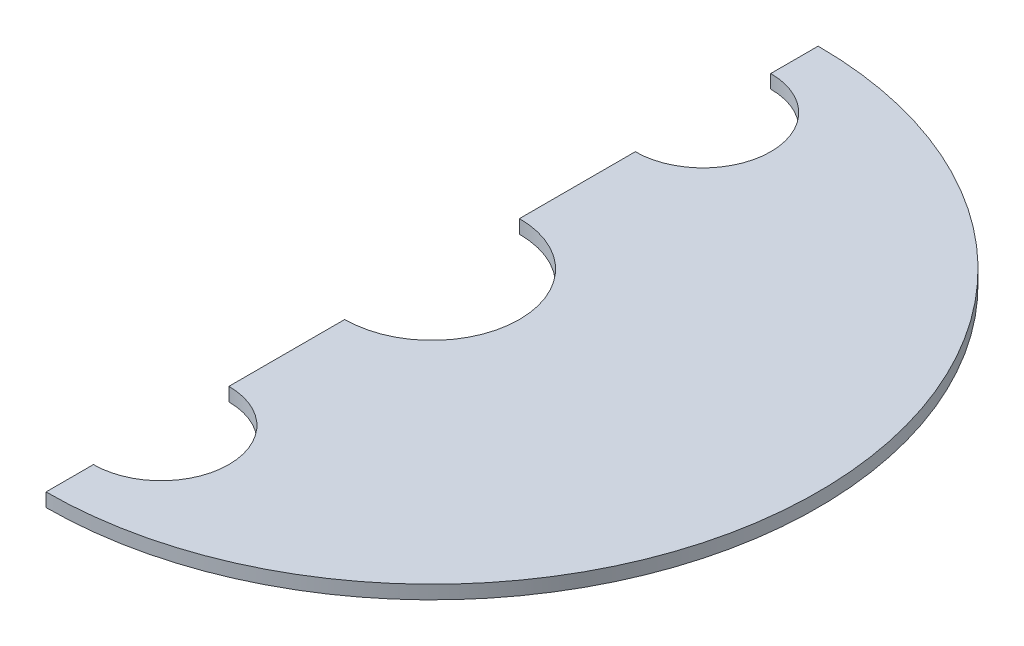
ISO-10303-21;
HEADER;
FILE_DESCRIPTION(('STEP AP214'),'2;1');
FILE_NAME('part.step','',(''),(''),'','','');
FILE_SCHEMA(('AUTOMOTIVE_DESIGN { 1 0 10303 214 1 1 1 1 }'));
ENDSEC;
DATA;
#1=APPLICATION_CONTEXT('core data for automotive mechanical design processes');
#2=APPLICATION_PROTOCOL_DEFINITION('international standard','automotive_design',2000,#1);
#3=PRODUCT_CONTEXT('',#1,'mechanical');
#4=PRODUCT('Part','Part','',(#3));
#5=PRODUCT_RELATED_PRODUCT_CATEGORY('part','',(#4));
#6=PRODUCT_DEFINITION_FORMATION('','',#4);
#7=PRODUCT_DEFINITION_CONTEXT('part definition',#1,'design');
#8=PRODUCT_DEFINITION('design','',#6,#7);
#9=PRODUCT_DEFINITION_SHAPE('','',#8);
#10=(LENGTH_UNIT() NAMED_UNIT(*) SI_UNIT(.MILLI.,.METRE.));
#11=(NAMED_UNIT(*) PLANE_ANGLE_UNIT() SI_UNIT($,.RADIAN.));
#12=(NAMED_UNIT(*) SI_UNIT($,.STERADIAN.) SOLID_ANGLE_UNIT());
#13=UNCERTAINTY_MEASURE_WITH_UNIT(LENGTH_MEASURE(1.E-05),#10,'distance_accuracy_value','');
#14=(GEOMETRIC_REPRESENTATION_CONTEXT(3) GLOBAL_UNCERTAINTY_ASSIGNED_CONTEXT((#13)) GLOBAL_UNIT_ASSIGNED_CONTEXT((#10,
#11,#12)) REPRESENTATION_CONTEXT('',''));
#15=CARTESIAN_POINT('',(0.,0.,0.));
#16=DIRECTION('',(0.,0.,1.));
#17=DIRECTION('',(1.,0.,0.));
#18=AXIS2_PLACEMENT_3D('',#15,#16,#17);
#19=CARTESIAN_POINT('',(0.,1.,-20.));
#20=DIRECTION('',(0.,-1.,0.));
#21=DIRECTION('',(0.,0.,-1.));
#22=AXIS2_PLACEMENT_3D('',#19,#20,#21);
#23=CYLINDRICAL_SURFACE('',#22,5.);
#24=CARTESIAN_POINT('',(0.,0.,-20.));
#25=DIRECTION('',(0.,1.,0.));
#26=DIRECTION('',(0.,0.,1.));
#27=AXIS2_PLACEMENT_3D('',#24,#25,#26);
#28=CIRCLE('',#27,5.);
#29=CARTESIAN_POINT('',(0.,0.,-15.));
#30=VERTEX_POINT('',#29);
#31=CARTESIAN_POINT('',(0.,0.,-25.));
#32=VERTEX_POINT('',#31);
#33=EDGE_CURVE('E129',#30,#32,#28,.T.);
#34=ORIENTED_EDGE('',*,*,#33,.F.);
#35=DIRECTION('',(0.,-1.,0.));
#36=VECTOR('',#35,1.);
#37=CARTESIAN_POINT('',(0.,1.,-15.));
#38=LINE('',#37,#36);
#39=CARTESIAN_POINT('',(0.,1.,-15.));
#40=VERTEX_POINT('',#39);
#41=EDGE_CURVE('E11',#40,#30,#38,.T.);
#42=ORIENTED_EDGE('',*,*,#41,.F.);
#43=CARTESIAN_POINT('',(0.,1.,-20.));
#44=DIRECTION('',(0.,1.,0.));
#45=DIRECTION('',(0.,0.,1.));
#46=AXIS2_PLACEMENT_3D('',#43,#44,#45);
#47=CIRCLE('',#46,5.);
#48=CARTESIAN_POINT('',(0.,1.,-25.));
#49=VERTEX_POINT('',#48);
#50=EDGE_CURVE('E148',#40,#49,#47,.T.);
#51=ORIENTED_EDGE('',*,*,#50,.T.);
#52=DIRECTION('',(0.,-1.,0.));
#53=VECTOR('',#52,1.);
#54=CARTESIAN_POINT('',(0.,1.,-25.));
#55=LINE('',#54,#53);
#56=EDGE_CURVE('E89',#49,#32,#55,.T.);
#57=ORIENTED_EDGE('',*,*,#56,.T.);
#58=EDGE_LOOP('',(#34,#42,#51,#57));
#59=FACE_BOUND('',#58,.T.);
#60=ADVANCED_FACE('F38',(#59),#23,.F.);
#61=CARTESIAN_POINT('',(0.,1.,0.));
#62=DIRECTION('',(-1.,0.,0.));
#63=DIRECTION('',(0.,0.,1.));
#64=AXIS2_PLACEMENT_3D('',#61,#62,#63);
#65=PLANE('',#64);
#66=DIRECTION('',(0.,0.,-1.));
#67=VECTOR('',#66,1.);
#68=CARTESIAN_POINT('',(0.,0.,0.));
#69=LINE('',#68,#67);
#70=CARTESIAN_POINT('',(0.,0.,-6.45));
#71=VERTEX_POINT('',#70);
#72=EDGE_CURVE('E132',#71,#30,#69,.T.);
#73=ORIENTED_EDGE('',*,*,#72,.F.);
#74=DIRECTION('',(0.,-1.,0.));
#75=VECTOR('',#74,1.);
#76=CARTESIAN_POINT('',(0.,1.,-6.45));
#77=LINE('',#76,#75);
#78=CARTESIAN_POINT('',(0.,1.,-6.45));
#79=VERTEX_POINT('',#78);
#80=EDGE_CURVE('E46',#79,#71,#77,.T.);
#81=ORIENTED_EDGE('',*,*,#80,.F.);
#82=DIRECTION('',(0.,0.,-1.));
#83=VECTOR('',#82,1.);
#84=CARTESIAN_POINT('',(0.,1.,0.));
#85=LINE('',#84,#83);
#86=EDGE_CURVE('E176',#79,#40,#85,.T.);
#87=ORIENTED_EDGE('',*,*,#86,.T.);
#88=ORIENTED_EDGE('',*,*,#41,.T.);
#89=EDGE_LOOP('',(#73,#81,#87,#88));
#90=FACE_BOUND('',#89,.T.);
#91=ADVANCED_FACE('F165',(#90),#65,.T.);
#92=CARTESIAN_POINT('',(0.,1.,0.));
#93=DIRECTION('',(0.,-1.,0.));
#94=DIRECTION('',(0.,0.,-1.));
#95=AXIS2_PLACEMENT_3D('',#92,#93,#94);
#96=CYLINDRICAL_SURFACE('',#95,6.45);
#97=CARTESIAN_POINT('',(0.,0.,0.));
#98=DIRECTION('',(0.,1.,0.));
#99=DIRECTION('',(0.,0.,1.));
#100=AXIS2_PLACEMENT_3D('',#97,#98,#99);
#101=CIRCLE('',#100,6.45);
#102=CARTESIAN_POINT('',(0.,0.,6.45));
#103=VERTEX_POINT('',#102);
#104=EDGE_CURVE('E135',#103,#71,#101,.T.);
#105=ORIENTED_EDGE('',*,*,#104,.F.);
#106=DIRECTION('',(0.,-1.,0.));
#107=VECTOR('',#106,1.);
#108=CARTESIAN_POINT('',(0.,1.,6.45));
#109=LINE('',#108,#107);
#110=CARTESIAN_POINT('',(0.,1.,6.45));
#111=VERTEX_POINT('',#110);
#112=EDGE_CURVE('E154',#111,#103,#109,.T.);
#113=ORIENTED_EDGE('',*,*,#112,.F.);
#114=CARTESIAN_POINT('',(0.,1.,0.));
#115=DIRECTION('',(0.,1.,0.));
#116=DIRECTION('',(0.,0.,1.));
#117=AXIS2_PLACEMENT_3D('',#114,#115,#116);
#118=CIRCLE('',#117,6.45);
#119=EDGE_CURVE('E161',#111,#79,#118,.T.);
#120=ORIENTED_EDGE('',*,*,#119,.T.);
#121=ORIENTED_EDGE('',*,*,#80,.T.);
#122=EDGE_LOOP('',(#105,#113,#120,#121));
#123=FACE_BOUND('',#122,.T.);
#124=ADVANCED_FACE('F159',(#123),#96,.F.);
#125=CARTESIAN_POINT('',(0.,1.,0.));
#126=DIRECTION('',(1.,0.,0.));
#127=DIRECTION('',(0.,0.,-1.));
#128=AXIS2_PLACEMENT_3D('',#125,#126,#127);
#129=PLANE('',#128);
#130=DIRECTION('',(0.,0.,1.));
#131=VECTOR('',#130,1.);
#132=CARTESIAN_POINT('',(0.,0.,0.));
#133=LINE('',#132,#131);
#134=CARTESIAN_POINT('',(0.,0.,15.));
#135=VERTEX_POINT('',#134);
#136=EDGE_CURVE('E138',#103,#135,#133,.T.);
#137=ORIENTED_EDGE('',*,*,#136,.T.);
#138=DIRECTION('',(0.,-1.,0.));
#139=VECTOR('',#138,1.);
#140=CARTESIAN_POINT('',(0.,1.,15.));
#141=LINE('',#140,#139);
#142=CARTESIAN_POINT('',(0.,1.,15.));
#143=VERTEX_POINT('',#142);
#144=EDGE_CURVE('E152',#143,#135,#141,.T.);
#145=ORIENTED_EDGE('',*,*,#144,.F.);
#146=DIRECTION('',(0.,0.,1.));
#147=VECTOR('',#146,1.);
#148=CARTESIAN_POINT('',(0.,1.,0.));
#149=LINE('',#148,#147);
#150=EDGE_CURVE('E174',#111,#143,#149,.T.);
#151=ORIENTED_EDGE('',*,*,#150,.F.);
#152=ORIENTED_EDGE('',*,*,#112,.T.);
#153=EDGE_LOOP('',(#137,#145,#151,#152));
#154=FACE_BOUND('',#153,.T.);
#155=ADVANCED_FACE('F172',(#154),#129,.F.);
#156=CARTESIAN_POINT('',(0.,1.,20.));
#157=DIRECTION('',(0.,-1.,0.));
#158=DIRECTION('',(0.,0.,-1.));
#159=AXIS2_PLACEMENT_3D('',#156,#157,#158);
#160=CYLINDRICAL_SURFACE('',#159,5.);
#161=CARTESIAN_POINT('',(0.,0.,20.));
#162=DIRECTION('',(0.,1.,0.));
#163=DIRECTION('',(0.,0.,1.));
#164=AXIS2_PLACEMENT_3D('',#161,#162,#163);
#165=CIRCLE('',#164,5.);
#166=CARTESIAN_POINT('',(0.,0.,25.));
#167=VERTEX_POINT('',#166);
#168=EDGE_CURVE('E141',#167,#135,#165,.T.);
#169=ORIENTED_EDGE('',*,*,#168,.F.);
#170=DIRECTION('',(0.,-1.,0.));
#171=VECTOR('',#170,1.);
#172=CARTESIAN_POINT('',(0.,1.,25.));
#173=LINE('',#172,#171);
#174=CARTESIAN_POINT('',(0.,1.,25.));
#175=VERTEX_POINT('',#174);
#176=EDGE_CURVE('E121',#175,#167,#173,.T.);
#177=ORIENTED_EDGE('',*,*,#176,.F.);
#178=CARTESIAN_POINT('',(0.,1.,20.));
#179=DIRECTION('',(0.,1.,0.));
#180=DIRECTION('',(0.,0.,1.));
#181=AXIS2_PLACEMENT_3D('',#178,#179,#180);
#182=CIRCLE('',#181,5.);
#183=EDGE_CURVE('E114',#175,#143,#182,.T.);
#184=ORIENTED_EDGE('',*,*,#183,.T.);
#185=ORIENTED_EDGE('',*,*,#144,.T.);
#186=EDGE_LOOP('',(#169,#177,#184,#185));
#187=FACE_BOUND('',#186,.T.);
#188=ADVANCED_FACE('F181',(#187),#160,.F.);
#189=CARTESIAN_POINT('',(0.,1.,0.));
#190=DIRECTION('',(1.,0.,0.));
#191=DIRECTION('',(0.,0.,-1.));
#192=AXIS2_PLACEMENT_3D('',#189,#190,#191);
#193=PLANE('',#192);
#194=DIRECTION('',(0.,0.,1.));
#195=VECTOR('',#194,1.);
#196=CARTESIAN_POINT('',(0.,0.,0.));
#197=LINE('',#196,#195);
#198=CARTESIAN_POINT('',(0.,0.,28.5));
#199=VERTEX_POINT('',#198);
#200=EDGE_CURVE('E120',#167,#199,#197,.T.);
#201=ORIENTED_EDGE('',*,*,#200,.T.);
#202=DIRECTION('',(0.,-1.,0.));
#203=VECTOR('',#202,1.);
#204=CARTESIAN_POINT('',(0.,1.,28.5));
#205=LINE('',#204,#203);
#206=CARTESIAN_POINT('',(0.,1.,28.5));
#207=VERTEX_POINT('',#206);
#208=EDGE_CURVE('E117',#207,#199,#205,.T.);
#209=ORIENTED_EDGE('',*,*,#208,.F.);
#210=DIRECTION('',(0.,0.,1.));
#211=VECTOR('',#210,1.);
#212=CARTESIAN_POINT('',(0.,1.,0.));
#213=LINE('',#212,#211);
#214=EDGE_CURVE('E108',#175,#207,#213,.T.);
#215=ORIENTED_EDGE('',*,*,#214,.F.);
#216=ORIENTED_EDGE('',*,*,#176,.T.);
#217=EDGE_LOOP('',(#201,#209,#215,#216));
#218=FACE_BOUND('',#217,.T.);
#219=ADVANCED_FACE('F118',(#218),#193,.F.);
#220=CARTESIAN_POINT('',(0.,1.,0.));
#221=DIRECTION('',(0.,-1.,0.));
#222=DIRECTION('',(0.,0.,-1.));
#223=AXIS2_PLACEMENT_3D('',#220,#221,#222);
#224=CYLINDRICAL_SURFACE('',#223,28.5);
#225=CARTESIAN_POINT('',(0.,0.,0.));
#226=DIRECTION('',(0.,1.,0.));
#227=DIRECTION('',(0.,0.,1.));
#228=AXIS2_PLACEMENT_3D('',#225,#226,#227);
#229=CIRCLE('',#228,28.5);
#230=CARTESIAN_POINT('',(0.,0.,-28.5));
#231=VERTEX_POINT('',#230);
#232=EDGE_CURVE('E82',#199,#231,#229,.T.);
#233=ORIENTED_EDGE('',*,*,#232,.T.);
#234=DIRECTION('',(0.,-1.,0.));
#235=VECTOR('',#234,1.);
#236=CARTESIAN_POINT('',(0.,1.,-28.5));
#237=LINE('',#236,#235);
#238=CARTESIAN_POINT('',(0.,1.,-28.5));
#239=VERTEX_POINT('',#238);
#240=EDGE_CURVE('E122',#239,#231,#237,.T.);
#241=ORIENTED_EDGE('',*,*,#240,.F.);
#242=CARTESIAN_POINT('',(0.,1.,0.));
#243=DIRECTION('',(0.,1.,0.));
#244=DIRECTION('',(0.,0.,1.));
#245=AXIS2_PLACEMENT_3D('',#242,#243,#244);
#246=CIRCLE('',#245,28.5);
#247=EDGE_CURVE('E112',#207,#239,#246,.T.);
#248=ORIENTED_EDGE('',*,*,#247,.F.);
#249=ORIENTED_EDGE('',*,*,#208,.T.);
#250=EDGE_LOOP('',(#233,#241,#248,#249));
#251=FACE_BOUND('',#250,.T.);
#252=ADVANCED_FACE('F124',(#251),#224,.T.);
#253=CARTESIAN_POINT('',(0.,1.,0.));
#254=DIRECTION('',(1.,0.,0.));
#255=DIRECTION('',(0.,0.,-1.));
#256=AXIS2_PLACEMENT_3D('',#253,#254,#255);
#257=PLANE('',#256);
#258=DIRECTION('',(0.,0.,1.));
#259=VECTOR('',#258,1.);
#260=CARTESIAN_POINT('',(0.,0.,0.));
#261=LINE('',#260,#259);
#262=EDGE_CURVE('E146',#231,#32,#261,.T.);
#263=ORIENTED_EDGE('',*,*,#262,.T.);
#264=ORIENTED_EDGE('',*,*,#56,.F.);
#265=DIRECTION('',(0.,0.,1.));
#266=VECTOR('',#265,1.);
#267=CARTESIAN_POINT('',(0.,1.,0.));
#268=LINE('',#267,#266);
#269=EDGE_CURVE('E54',#239,#49,#268,.T.);
#270=ORIENTED_EDGE('',*,*,#269,.F.);
#271=ORIENTED_EDGE('',*,*,#240,.T.);
#272=EDGE_LOOP('',(#263,#264,#270,#271));
#273=FACE_BOUND('',#272,.T.);
#274=ADVANCED_FACE('F184',(#273),#257,.F.);
#275=CARTESIAN_POINT('',(0.,1.,0.));
#276=DIRECTION('',(0.,1.,0.));
#277=DIRECTION('',(0.,0.,1.));
#278=AXIS2_PLACEMENT_3D('',#275,#276,#277);
#279=PLANE('',#278);
#280=ORIENTED_EDGE('',*,*,#50,.F.);
#281=ORIENTED_EDGE('',*,*,#86,.F.);
#282=ORIENTED_EDGE('',*,*,#119,.F.);
#283=ORIENTED_EDGE('',*,*,#150,.T.);
#284=ORIENTED_EDGE('',*,*,#183,.F.);
#285=ORIENTED_EDGE('',*,*,#214,.T.);
#286=ORIENTED_EDGE('',*,*,#247,.T.);
#287=ORIENTED_EDGE('',*,*,#269,.T.);
#288=EDGE_LOOP('',(#280,#281,#282,#283,#284,#285,#286,#287));
#289=FACE_BOUND('',#288,.T.);
#290=ADVANCED_FACE('F110',(#289),#279,.T.);
#291=CARTESIAN_POINT('',(0.,0.,0.));
#292=DIRECTION('',(0.,1.,0.));
#293=DIRECTION('',(0.,0.,1.));
#294=AXIS2_PLACEMENT_3D('',#291,#292,#293);
#295=PLANE('',#294);
#296=ORIENTED_EDGE('',*,*,#33,.T.);
#297=ORIENTED_EDGE('',*,*,#262,.F.);
#298=ORIENTED_EDGE('',*,*,#232,.F.);
#299=ORIENTED_EDGE('',*,*,#200,.F.);
#300=ORIENTED_EDGE('',*,*,#168,.T.);
#301=ORIENTED_EDGE('',*,*,#136,.F.);
#302=ORIENTED_EDGE('',*,*,#104,.T.);
#303=ORIENTED_EDGE('',*,*,#72,.T.);
#304=EDGE_LOOP('',(#296,#297,#298,#299,#300,#301,#302,#303));
#305=FACE_BOUND('',#304,.T.);
#306=ADVANCED_FACE('F168',(#305),#295,.F.);
#307=CLOSED_SHELL('',(#60,#91,#124,#155,#188,#219,#252,#274,#290,#306));
#308=MANIFOLD_SOLID_BREP('B2',#307);
#309=ADVANCED_BREP_SHAPE_REPRESENTATION('',(#18,#308),#14);
#310=SHAPE_DEFINITION_REPRESENTATION(#9,#309);
ENDSEC;
END-ISO-10303-21;
